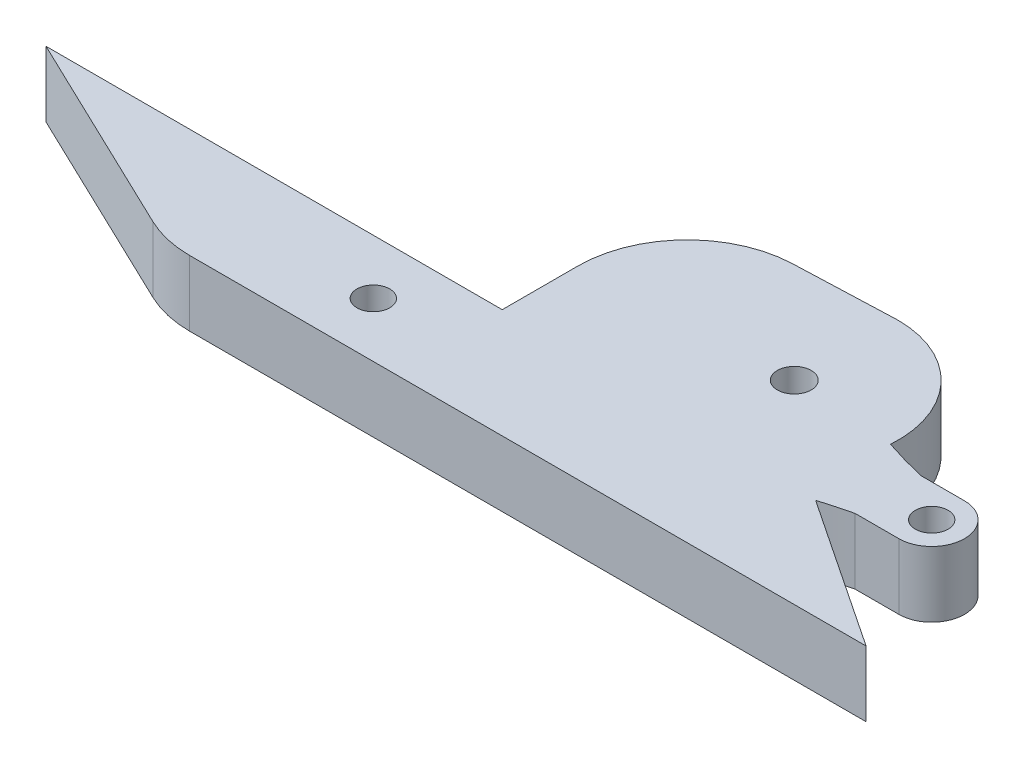
ISO-10303-21;
HEADER;
FILE_DESCRIPTION(('STEP AP214'),'2;1');
FILE_NAME('part.step','',(''),(''),'','','');
FILE_SCHEMA(('AUTOMOTIVE_DESIGN { 1 0 10303 214 1 1 1 1 }'));
ENDSEC;
DATA;
#1=APPLICATION_CONTEXT('core data for automotive mechanical design processes');
#2=APPLICATION_PROTOCOL_DEFINITION('international standard','automotive_design',2000,#1);
#3=PRODUCT_CONTEXT('',#1,'mechanical');
#4=PRODUCT('Part','Part','',(#3));
#5=PRODUCT_RELATED_PRODUCT_CATEGORY('part','',(#4));
#6=PRODUCT_DEFINITION_FORMATION('','',#4);
#7=PRODUCT_DEFINITION_CONTEXT('part definition',#1,'design');
#8=PRODUCT_DEFINITION('design','',#6,#7);
#9=PRODUCT_DEFINITION_SHAPE('','',#8);
#10=(LENGTH_UNIT() NAMED_UNIT(*) SI_UNIT(.MILLI.,.METRE.));
#11=(NAMED_UNIT(*) PLANE_ANGLE_UNIT() SI_UNIT($,.RADIAN.));
#12=(NAMED_UNIT(*) SI_UNIT($,.STERADIAN.) SOLID_ANGLE_UNIT());
#13=UNCERTAINTY_MEASURE_WITH_UNIT(LENGTH_MEASURE(1.E-05),#10,'distance_accuracy_value','');
#14=(GEOMETRIC_REPRESENTATION_CONTEXT(3) GLOBAL_UNCERTAINTY_ASSIGNED_CONTEXT((#13)) GLOBAL_UNIT_ASSIGNED_CONTEXT((#10,
#11,#12)) REPRESENTATION_CONTEXT('',''));
#15=CARTESIAN_POINT('',(0.,0.,0.));
#16=DIRECTION('',(0.,0.,1.));
#17=DIRECTION('',(1.,0.,0.));
#18=AXIS2_PLACEMENT_3D('',#15,#16,#17);
#19=CARTESIAN_POINT('',(1.15544671598219,6.,0.770297810654092));
#20=CARTESIAN_POINT('',(2.09450954617625,6.,0.48138849807879));
#21=CARTESIAN_POINT('',(3.04269397418197,6.,0.224622561194157));
#22=CARTESIAN_POINT('',(4.,6.,0.));
#23=B_SPLINE_CURVE_WITH_KNOTS('',3,(#19,#20,#21,#22),.UNSPECIFIED.,.F.,.F.,(4,4),
(0.26525085735006,1.),.UNSPECIFIED.);
#24=DIRECTION('',(0.,-1.,0.));
#25=VECTOR('',#24,1.);
#26=SURFACE_OF_LINEAR_EXTRUSION('',#23,#25);
#27=CARTESIAN_POINT('',(1.15544671598219,0.,0.770297810654092));
#28=CARTESIAN_POINT('',(2.09450954617625,0.,0.48138849807879));
#29=CARTESIAN_POINT('',(3.04269397418197,0.,0.224622561194157));
#30=CARTESIAN_POINT('',(4.,0.,0.));
#31=B_SPLINE_CURVE_WITH_KNOTS('',3,(#27,#28,#29,#30),.UNSPECIFIED.,.F.,.F.,(4,4),
(0.26525085735006,1.),.UNSPECIFIED.);
#32=CARTESIAN_POINT('',(1.15544671598219,0.,0.770297810654092));
#33=VERTEX_POINT('',#32);
#34=CARTESIAN_POINT('',(4.,0.,0.));
#35=VERTEX_POINT('',#34);
#36=EDGE_CURVE('E180',#33,#35,#31,.T.);
#37=ORIENTED_EDGE('',*,*,#36,.T.);
#38=DIRECTION('',(0.,-1.,0.));
#39=VECTOR('',#38,1.);
#40=CARTESIAN_POINT('',(4.,6.,0.));
#41=LINE('',#40,#39);
#42=CARTESIAN_POINT('',(4.,6.,0.));
#43=VERTEX_POINT('',#42);
#44=EDGE_CURVE('E11',#43,#35,#41,.T.);
#45=ORIENTED_EDGE('',*,*,#44,.F.);
#46=CARTESIAN_POINT('',(1.15544671598219,6.,0.770297810654092));
#47=VERTEX_POINT('',#46);
#48=EDGE_CURVE('E236',#47,#43,#23,.T.);
#49=ORIENTED_EDGE('',*,*,#48,.F.);
#50=DIRECTION('',(0.,-1.,0.));
#51=VECTOR('',#50,1.);
#52=CARTESIAN_POINT('',(1.15544671598219,6.,0.770297810654092));
#53=LINE('',#52,#51);
#54=EDGE_CURVE('E53',#47,#33,#53,.T.);
#55=ORIENTED_EDGE('',*,*,#54,.T.);
#56=EDGE_LOOP('',(#37,#45,#49,#55));
#57=FACE_BOUND('',#56,.T.);
#58=ADVANCED_FACE('F36',(#57),#26,.F.);
#59=CARTESIAN_POINT('',(0.,6.,0.));
#60=DIRECTION('',(0.,0.,-1.));
#61=DIRECTION('',(-1.,0.,0.));
#62=AXIS2_PLACEMENT_3D('',#59,#60,#61);
#63=PLANE('',#62);
#64=DIRECTION('',(1.,0.,0.));
#65=VECTOR('',#64,1.);
#66=CARTESIAN_POINT('',(0.,0.,0.));
#67=LINE('',#66,#65);
#68=CARTESIAN_POINT('',(8.,0.,0.));
#69=VERTEX_POINT('',#68);
#70=EDGE_CURVE('E184',#35,#69,#67,.T.);
#71=ORIENTED_EDGE('',*,*,#70,.T.);
#72=DIRECTION('',(0.,-1.,0.));
#73=VECTOR('',#72,1.);
#74=CARTESIAN_POINT('',(8.,6.,0.));
#75=LINE('',#74,#73);
#76=CARTESIAN_POINT('',(8.,6.,0.));
#77=VERTEX_POINT('',#76);
#78=EDGE_CURVE('E45',#77,#69,#75,.T.);
#79=ORIENTED_EDGE('',*,*,#78,.F.);
#80=DIRECTION('',(1.,0.,0.));
#81=VECTOR('',#80,1.);
#82=CARTESIAN_POINT('',(0.,6.,0.));
#83=LINE('',#82,#81);
#84=EDGE_CURVE('E109',#43,#77,#83,.T.);
#85=ORIENTED_EDGE('',*,*,#84,.F.);
#86=ORIENTED_EDGE('',*,*,#44,.T.);
#87=EDGE_LOOP('',(#71,#79,#85,#86));
#88=FACE_BOUND('',#87,.T.);
#89=ADVANCED_FACE('F300',(#88),#63,.F.);
#90=CARTESIAN_POINT('',(8.,6.,-3.));
#91=DIRECTION('',(0.,-1.,0.));
#92=DIRECTION('',(0.,0.,-1.));
#93=AXIS2_PLACEMENT_3D('',#90,#91,#92);
#94=CYLINDRICAL_SURFACE('',#93,3.);
#95=CARTESIAN_POINT('',(8.,0.,-3.));
#96=DIRECTION('',(0.,1.,0.));
#97=DIRECTION('',(0.,0.,1.));
#98=AXIS2_PLACEMENT_3D('',#95,#96,#97);
#99=CIRCLE('',#98,3.);
#100=CARTESIAN_POINT('',(8.,0.,-6.));
#101=VERTEX_POINT('',#100);
#102=EDGE_CURVE('E189',#69,#101,#99,.T.);
#103=ORIENTED_EDGE('',*,*,#102,.T.);
#104=DIRECTION('',(0.,-1.,0.));
#105=VECTOR('',#104,1.);
#106=CARTESIAN_POINT('',(8.,6.,-6.));
#107=LINE('',#106,#105);
#108=CARTESIAN_POINT('',(8.,6.,-6.));
#109=VERTEX_POINT('',#108);
#110=EDGE_CURVE('E254',#109,#101,#107,.T.);
#111=ORIENTED_EDGE('',*,*,#110,.F.);
#112=CARTESIAN_POINT('',(8.,6.,-3.));
#113=DIRECTION('',(0.,1.,0.));
#114=DIRECTION('',(0.,0.,1.));
#115=AXIS2_PLACEMENT_3D('',#112,#113,#114);
#116=CIRCLE('',#115,3.);
#117=EDGE_CURVE('E261',#77,#109,#116,.T.);
#118=ORIENTED_EDGE('',*,*,#117,.F.);
#119=ORIENTED_EDGE('',*,*,#78,.T.);
#120=EDGE_LOOP('',(#103,#111,#118,#119));
#121=FACE_BOUND('',#120,.T.);
#122=ADVANCED_FACE('F259',(#121),#94,.T.);
#123=CARTESIAN_POINT('',(0.,6.,-6.));
#124=DIRECTION('',(0.,0.,-1.));
#125=DIRECTION('',(-1.,0.,0.));
#126=AXIS2_PLACEMENT_3D('',#123,#124,#125);
#127=PLANE('',#126);
#128=DIRECTION('',(1.,0.,0.));
#129=VECTOR('',#128,1.);
#130=CARTESIAN_POINT('',(0.,0.,-6.));
#131=LINE('',#130,#129);
#132=CARTESIAN_POINT('',(4.,0.,-6.));
#133=VERTEX_POINT('',#132);
#134=EDGE_CURVE('E192',#133,#101,#131,.T.);
#135=ORIENTED_EDGE('',*,*,#134,.F.);
#136=DIRECTION('',(0.,-1.,0.));
#137=VECTOR('',#136,1.);
#138=CARTESIAN_POINT('',(4.,6.,-6.));
#139=LINE('',#138,#137);
#140=CARTESIAN_POINT('',(4.,6.,-6.));
#141=VERTEX_POINT('',#140);
#142=EDGE_CURVE('E252',#141,#133,#139,.T.);
#143=ORIENTED_EDGE('',*,*,#142,.F.);
#144=DIRECTION('',(1.,0.,0.));
#145=VECTOR('',#144,1.);
#146=CARTESIAN_POINT('',(0.,6.,-6.));
#147=LINE('',#146,#145);
#148=EDGE_CURVE('E272',#141,#109,#147,.T.);
#149=ORIENTED_EDGE('',*,*,#148,.T.);
#150=ORIENTED_EDGE('',*,*,#110,.T.);
#151=EDGE_LOOP('',(#135,#143,#149,#150));
#152=FACE_BOUND('',#151,.T.);
#153=ADVANCED_FACE('F269',(#152),#127,.T.);
#154=CARTESIAN_POINT('',(0.141983447062552,6.,-7.09576164428797));
#155=CARTESIAN_POINT('',(2.04564720749744,6.,-6.45856990125361));
#156=CARTESIAN_POINT('',(4.,6.,-6.));
#157=B_SPLINE_CURVE_WITH_KNOTS('',2,(#154,#155,#156),.UNSPECIFIED.,.F.,.F.,(3,3),(0.,1.),.UNSPECIFIED.);
#158=DIRECTION('',(0.,-1.,0.));
#159=VECTOR('',#158,1.);
#160=SURFACE_OF_LINEAR_EXTRUSION('',#157,#159);
#161=CARTESIAN_POINT('',(0.141983447062552,0.,-7.09576164428797));
#162=CARTESIAN_POINT('',(2.04564720749744,0.,-6.45856990125361));
#163=CARTESIAN_POINT('',(4.,0.,-6.));
#164=B_SPLINE_CURVE_WITH_KNOTS('',2,(#161,#162,#163),.UNSPECIFIED.,.F.,.F.,(3,3),(0.,1.),.UNSPECIFIED.);
#165=CARTESIAN_POINT('',(0.141983447062552,0.,-7.09576164428797));
#166=VERTEX_POINT('',#165);
#167=EDGE_CURVE('E195',#166,#133,#164,.T.);
#168=ORIENTED_EDGE('',*,*,#167,.F.);
#169=DIRECTION('',(0.,-1.,0.));
#170=VECTOR('',#169,1.);
#171=CARTESIAN_POINT('',(0.141983447062552,6.,-7.09576164428797));
#172=LINE('',#171,#170);
#173=CARTESIAN_POINT('',(0.141983447062552,6.,-7.09576164428797));
#174=VERTEX_POINT('',#173);
#175=EDGE_CURVE('E250',#174,#166,#172,.T.);
#176=ORIENTED_EDGE('',*,*,#175,.F.);
#177=EDGE_CURVE('E275',#174,#141,#157,.T.);
#178=ORIENTED_EDGE('',*,*,#177,.T.);
#179=ORIENTED_EDGE('',*,*,#142,.T.);
#180=EDGE_LOOP('',(#168,#176,#178,#179));
#181=FACE_BOUND('',#180,.T.);
#182=ADVANCED_FACE('F290',(#181),#160,.T.);
#183=CARTESIAN_POINT('',(-9.33430338024911,6.,-7.76657306825106));
#184=DIRECTION('',(0.,-1.,0.));
#185=DIRECTION('',(0.,0.,-1.));
#186=AXIS2_PLACEMENT_3D('',#183,#184,#185);
#187=CYLINDRICAL_SURFACE('',#186,9.5);
#188=CARTESIAN_POINT('',(-9.33430338024911,0.,-7.76657306825106));
#189=DIRECTION('',(0.,1.,0.));
#190=DIRECTION('',(0.,0.,1.));
#191=AXIS2_PLACEMENT_3D('',#188,#189,#190);
#192=CIRCLE('',#191,9.5);
#193=CARTESIAN_POINT('',(-9.33430338024912,0.,-17.2665730682511));
#194=VERTEX_POINT('',#193);
#195=EDGE_CURVE('E200',#166,#194,#192,.T.);
#196=ORIENTED_EDGE('',*,*,#195,.T.);
#197=DIRECTION('',(0.,-1.,0.));
#198=VECTOR('',#197,1.);
#199=CARTESIAN_POINT('',(-9.33430338024912,6.,-17.2665730682511));
#200=LINE('',#199,#198);
#201=CARTESIAN_POINT('',(-9.33430338024912,6.,-17.2665730682511));
#202=VERTEX_POINT('',#201);
#203=EDGE_CURVE('E248',#202,#194,#200,.T.);
#204=ORIENTED_EDGE('',*,*,#203,.F.);
#205=CARTESIAN_POINT('',(-9.33430338024911,6.,-7.76657306825106));
#206=DIRECTION('',(0.,1.,0.));
#207=DIRECTION('',(0.,0.,1.));
#208=AXIS2_PLACEMENT_3D('',#205,#206,#207);
#209=CIRCLE('',#208,9.5);
#210=EDGE_CURVE('E277',#174,#202,#209,.T.);
#211=ORIENTED_EDGE('',*,*,#210,.F.);
#212=ORIENTED_EDGE('',*,*,#175,.T.);
#213=EDGE_LOOP('',(#196,#204,#211,#212));
#214=FACE_BOUND('',#213,.T.);
#215=ADVANCED_FACE('F294',(#214),#187,.T.);
#216=CARTESIAN_POINT('',(-0.667994009795977,6.,-17.5955786029445));
#217=DIRECTION('',(-0.0379364141874344,0.,-0.999280155150996));
#218=DIRECTION('',(-0.999280155150996,0.,0.0379364141874344));
#219=AXIS2_PLACEMENT_3D('',#216,#217,#218);
#220=PLANE('',#219);
#221=DIRECTION('',(0.999280155150996,0.,-0.0379364141874344));
#222=VECTOR('',#221,1.);
#223=CARTESIAN_POINT('',(-0.667994009795977,0.,-17.5955786029445));
#224=LINE('',#223,#222);
#225=CARTESIAN_POINT('',(-18.6545724164585,0.,-16.9127407774031));
#226=VERTEX_POINT('',#225);
#227=EDGE_CURVE('E206',#226,#194,#224,.T.);
#228=ORIENTED_EDGE('',*,*,#227,.F.);
#229=DIRECTION('',(0.,-1.,0.));
#230=VECTOR('',#229,1.);
#231=CARTESIAN_POINT('',(-18.6545724164585,6.,-16.9127407774031));
#232=LINE('',#231,#230);
#233=CARTESIAN_POINT('',(-18.6545724164585,6.,-16.9127407774031));
#234=VERTEX_POINT('',#233);
#235=EDGE_CURVE('E246',#234,#226,#232,.T.);
#236=ORIENTED_EDGE('',*,*,#235,.F.);
#237=DIRECTION('',(0.999280155150996,0.,-0.0379364141874344));
#238=VECTOR('',#237,1.);
#239=CARTESIAN_POINT('',(-0.667994009795977,6.,-17.5955786029445));
#240=LINE('',#239,#238);
#241=EDGE_CURVE('E360',#234,#202,#240,.T.);
#242=ORIENTED_EDGE('',*,*,#241,.T.);
#243=ORIENTED_EDGE('',*,*,#203,.T.);
#244=EDGE_LOOP('',(#228,#236,#242,#243));
#245=FACE_BOUND('',#244,.T.);
#246=ADVANCED_FACE('F340',(#245),#220,.T.);
#247=CARTESIAN_POINT('',(-18.2752082745844,6.,-6.91993922589314));
#248=DIRECTION('',(0.,-1.,0.));
#249=DIRECTION('',(0.,0.,-1.));
#250=AXIS2_PLACEMENT_3D('',#247,#248,#249);
#251=CYLINDRICAL_SURFACE('',#250,9.9999999999999);
#252=CARTESIAN_POINT('',(-18.2752082745844,0.,-6.91993922589314));
#253=DIRECTION('',(0.,1.,0.));
#254=DIRECTION('',(0.,0.,1.));
#255=AXIS2_PLACEMENT_3D('',#252,#253,#254);
#256=CIRCLE('',#255,9.9999999999999);
#257=CARTESIAN_POINT('',(-28.2752082745842,0.,-6.91993922589316));
#258=VERTEX_POINT('',#257);
#259=EDGE_CURVE('E209',#226,#258,#256,.T.);
#260=ORIENTED_EDGE('',*,*,#259,.T.);
#261=DIRECTION('',(0.,-1.,0.));
#262=VECTOR('',#261,1.);
#263=CARTESIAN_POINT('',(-28.2752082745842,6.,-6.91993922589316));
#264=LINE('',#263,#262);
#265=CARTESIAN_POINT('',(-28.2752082745842,6.,-6.91993922589316));
#266=VERTEX_POINT('',#265);
#267=EDGE_CURVE('E244',#266,#258,#264,.T.);
#268=ORIENTED_EDGE('',*,*,#267,.F.);
#269=CARTESIAN_POINT('',(-18.2752082745844,6.,-6.91993922589314));
#270=DIRECTION('',(0.,1.,0.));
#271=DIRECTION('',(0.,0.,1.));
#272=AXIS2_PLACEMENT_3D('',#269,#270,#271);
#273=CIRCLE('',#272,9.9999999999999);
#274=EDGE_CURVE('E356',#234,#266,#273,.T.);
#275=ORIENTED_EDGE('',*,*,#274,.F.);
#276=ORIENTED_EDGE('',*,*,#235,.T.);
#277=EDGE_LOOP('',(#260,#268,#275,#276));
#278=FACE_BOUND('',#277,.T.);
#279=ADVANCED_FACE('F337',(#278),#251,.T.);
#280=CARTESIAN_POINT('',(-28.2752082745844,6.,-1.11992999143204E-12));
#281=DIRECTION('',(-1.,0.,0.));
#282=DIRECTION('',(0.,0.,1.));
#283=AXIS2_PLACEMENT_3D('',#280,#281,#282);
#284=PLANE('',#283);
#285=DIRECTION('',(0.,0.,-1.));
#286=VECTOR('',#285,1.);
#287=CARTESIAN_POINT('',(-28.2752082745844,0.,-1.11992999143204E-12));
#288=LINE('',#287,#286);
#289=CARTESIAN_POINT('',(-28.2752082745844,0.,0.));
#290=VERTEX_POINT('',#289);
#291=EDGE_CURVE('E212',#290,#258,#288,.T.);
#292=ORIENTED_EDGE('',*,*,#291,.F.);
#293=DIRECTION('',(0.,-1.,0.));
#294=VECTOR('',#293,1.);
#295=CARTESIAN_POINT('',(-28.2752082745844,6.,0.));
#296=LINE('',#295,#294);
#297=CARTESIAN_POINT('',(-28.2752082745844,6.,0.));
#298=VERTEX_POINT('',#297);
#299=EDGE_CURVE('E242',#298,#290,#296,.T.);
#300=ORIENTED_EDGE('',*,*,#299,.F.);
#301=DIRECTION('',(0.,0.,-1.));
#302=VECTOR('',#301,1.);
#303=CARTESIAN_POINT('',(-28.2752082745844,6.,-1.11992999143204E-12));
#304=LINE('',#303,#302);
#305=EDGE_CURVE('E359',#298,#266,#304,.T.);
#306=ORIENTED_EDGE('',*,*,#305,.T.);
#307=ORIENTED_EDGE('',*,*,#267,.T.);
#308=EDGE_LOOP('',(#292,#300,#306,#307));
#309=FACE_BOUND('',#308,.T.);
#310=ADVANCED_FACE('F333',(#309),#284,.T.);
#311=CARTESIAN_POINT('',(0.,6.,0.));
#312=DIRECTION('',(0.,0.,-1.));
#313=DIRECTION('',(-1.,0.,0.));
#314=AXIS2_PLACEMENT_3D('',#311,#312,#313);
#315=PLANE('',#314);
#316=DIRECTION('',(1.,0.,0.));
#317=VECTOR('',#316,1.);
#318=CARTESIAN_POINT('',(0.,0.,0.));
#319=LINE('',#318,#317);
#320=CARTESIAN_POINT('',(-69.9999999999863,0.,0.));
#321=VERTEX_POINT('',#320);
#322=EDGE_CURVE('E215',#321,#290,#319,.T.);
#323=ORIENTED_EDGE('',*,*,#322,.F.);
#324=DIRECTION('',(0.,-1.,0.));
#325=VECTOR('',#324,1.);
#326=CARTESIAN_POINT('',(-69.9999999999863,6.,0.));
#327=LINE('',#326,#325);
#328=CARTESIAN_POINT('',(-69.9999999999863,6.,0.));
#329=VERTEX_POINT('',#328);
#330=EDGE_CURVE('E240',#329,#321,#327,.T.);
#331=ORIENTED_EDGE('',*,*,#330,.F.);
#332=DIRECTION('',(1.,0.,0.));
#333=VECTOR('',#332,1.);
#334=CARTESIAN_POINT('',(0.,6.,0.));
#335=LINE('',#334,#333);
#336=EDGE_CURVE('E365',#329,#298,#335,.T.);
#337=ORIENTED_EDGE('',*,*,#336,.T.);
#338=ORIENTED_EDGE('',*,*,#299,.T.);
#339=EDGE_LOOP('',(#323,#331,#337,#338));
#340=FACE_BOUND('',#339,.T.);
#341=ADVANCED_FACE('F329',(#340),#315,.T.);
#342=CARTESIAN_POINT('',(-13.0782559966181,6.,27.28437537951));
#343=DIRECTION('',(-0.432240938046308,0.,0.901758155758431));
#344=DIRECTION('',(0.901758155758432,0.,0.432240938046309));
#345=AXIS2_PLACEMENT_3D('',#342,#343,#344);
#346=PLANE('',#345);
#347=DIRECTION('',(-0.901758155758431,0.,-0.432240938046308));
#348=VECTOR('',#347,1.);
#349=CARTESIAN_POINT('',(-13.0782559966181,0.,27.28437537951));
#350=LINE('',#349,#348);
#351=CARTESIAN_POINT('',(-51.187164382141,0.,9.01758155758431));
#352=VERTEX_POINT('',#351);
#353=EDGE_CURVE('E218',#352,#321,#350,.T.);
#354=ORIENTED_EDGE('',*,*,#353,.F.);
#355=DIRECTION('',(0.,-1.,0.));
#356=VECTOR('',#355,1.);
#357=CARTESIAN_POINT('',(-51.187164382141,6.,9.01758155758431));
#358=LINE('',#357,#356);
#359=CARTESIAN_POINT('',(-51.187164382141,6.,9.01758155758431));
#360=VERTEX_POINT('',#359);
#361=EDGE_CURVE('E152',#360,#352,#358,.T.);
#362=ORIENTED_EDGE('',*,*,#361,.F.);
#363=DIRECTION('',(-0.901758155758431,0.,-0.432240938046308));
#364=VECTOR('',#363,1.);
#365=CARTESIAN_POINT('',(-13.0782559966181,6.,27.28437537951));
#366=LINE('',#365,#364);
#367=EDGE_CURVE('E163',#360,#329,#366,.T.);
#368=ORIENTED_EDGE('',*,*,#367,.T.);
#369=ORIENTED_EDGE('',*,*,#330,.T.);
#370=EDGE_LOOP('',(#354,#362,#368,#369));
#371=FACE_BOUND('',#370,.T.);
#372=ADVANCED_FACE('F326',(#371),#346,.T.);
#373=CARTESIAN_POINT('',(-46.8647550016779,6.,0.));
#374=DIRECTION('',(0.,-1.,0.));
#375=DIRECTION('',(0.,0.,-1.));
#376=AXIS2_PLACEMENT_3D('',#373,#374,#375);
#377=CYLINDRICAL_SURFACE('',#376,10.);
#378=CARTESIAN_POINT('',(-46.8647550016779,0.,0.));
#379=DIRECTION('',(0.,1.,0.));
#380=DIRECTION('',(0.,0.,1.));
#381=AXIS2_PLACEMENT_3D('',#378,#379,#380);
#382=CIRCLE('',#381,10.);
#383=CARTESIAN_POINT('',(-46.8647550016778,0.,10.));
#384=VERTEX_POINT('',#383);
#385=EDGE_CURVE('E148',#384,#352,#382,.F.);
#386=ORIENTED_EDGE('',*,*,#385,.F.);
#387=DIRECTION('',(0.,-1.,0.));
#388=VECTOR('',#387,1.);
#389=CARTESIAN_POINT('',(-46.8647550016778,6.,10.));
#390=LINE('',#389,#388);
#391=CARTESIAN_POINT('',(-46.8647550016778,6.,10.));
#392=VERTEX_POINT('',#391);
#393=EDGE_CURVE('E143',#392,#384,#390,.T.);
#394=ORIENTED_EDGE('',*,*,#393,.F.);
#395=CARTESIAN_POINT('',(-46.8647550016779,6.,0.));
#396=DIRECTION('',(0.,1.,0.));
#397=DIRECTION('',(0.,0.,1.));
#398=AXIS2_PLACEMENT_3D('',#395,#396,#397);
#399=CIRCLE('',#398,10.);
#400=EDGE_CURVE('E146',#392,#360,#399,.F.);
#401=ORIENTED_EDGE('',*,*,#400,.T.);
#402=ORIENTED_EDGE('',*,*,#361,.T.);
#403=EDGE_LOOP('',(#386,#394,#401,#402));
#404=FACE_BOUND('',#403,.T.);
#405=ADVANCED_FACE('F145',(#404),#377,.T.);
#406=CARTESIAN_POINT('',(0.,6.,10.));
#407=DIRECTION('',(0.,0.,1.));
#408=DIRECTION('',(1.,0.,0.));
#409=AXIS2_PLACEMENT_3D('',#406,#407,#408);
#410=PLANE('',#409);
#411=DIRECTION('',(-1.,0.,0.));
#412=VECTOR('',#411,1.);
#413=CARTESIAN_POINT('',(0.,0.,10.));
#414=LINE('',#413,#412);
#415=CARTESIAN_POINT('',(15.0000000000137,0.,10.));
#416=VERTEX_POINT('',#415);
#417=EDGE_CURVE('E222',#416,#384,#414,.T.);
#418=ORIENTED_EDGE('',*,*,#417,.F.);
#419=DIRECTION('',(0.,-1.,0.));
#420=VECTOR('',#419,1.);
#421=CARTESIAN_POINT('',(15.0000000000137,6.,10.));
#422=LINE('',#421,#420);
#423=CARTESIAN_POINT('',(15.0000000000137,6.,10.));
#424=VERTEX_POINT('',#423);
#425=EDGE_CURVE('E97',#424,#416,#422,.T.);
#426=ORIENTED_EDGE('',*,*,#425,.F.);
#427=DIRECTION('',(-1.,0.,0.));
#428=VECTOR('',#427,1.);
#429=CARTESIAN_POINT('',(0.,6.,10.));
#430=LINE('',#429,#428);
#431=EDGE_CURVE('E160',#424,#392,#430,.T.);
#432=ORIENTED_EDGE('',*,*,#431,.T.);
#433=ORIENTED_EDGE('',*,*,#393,.T.);
#434=EDGE_LOOP('',(#418,#426,#432,#433));
#435=FACE_BOUND('',#434,.T.);
#436=ADVANCED_FACE('F165',(#435),#410,.T.);
#437=CARTESIAN_POINT('',(-35.0638414589827,6.,5.));
#438=DIRECTION('',(0.,-1.,0.));
#439=DIRECTION('',(0.,0.,-1.));
#440=AXIS2_PLACEMENT_3D('',#437,#438,#439);
#441=CYLINDRICAL_SURFACE('',#440,1.5);
#442=CARTESIAN_POINT('',(-35.0638414589827,6.,5.));
#443=DIRECTION('',(0.,1.,0.));
#444=DIRECTION('',(0.,0.,1.));
#445=AXIS2_PLACEMENT_3D('',#442,#443,#444);
#446=CIRCLE('',#445,1.5);
#447=CARTESIAN_POINT('',(-35.0638414589827,6.,6.50000000000001));
#448=VERTEX_POINT('',#447);
#449=EDGE_CURVE('E174',#448,#448,#446,.T.);
#450=ORIENTED_EDGE('',*,*,#449,.T.);
#451=EDGE_LOOP('',(#450));
#452=FACE_BOUND('',#451,.T.);
#453=CARTESIAN_POINT('',(-35.0638414589827,0.,5.));
#454=DIRECTION('',(0.,1.,0.));
#455=DIRECTION('',(0.,0.,1.));
#456=AXIS2_PLACEMENT_3D('',#453,#454,#455);
#457=CIRCLE('',#456,1.5);
#458=CARTESIAN_POINT('',(-35.0638414589827,0.,6.50000000000001));
#459=VERTEX_POINT('',#458);
#460=EDGE_CURVE('E230',#459,#459,#457,.T.);
#461=ORIENTED_EDGE('',*,*,#460,.F.);
#462=EDGE_LOOP('',(#461));
#463=FACE_BOUND('',#462,.T.);
#464=ADVANCED_FACE('F317',(#452,#463),#441,.F.);
#465=CARTESIAN_POINT('',(-9.33430338024911,6.,-7.76657306825106));
#466=DIRECTION('',(0.,-1.,0.));
#467=DIRECTION('',(0.,0.,-1.));
#468=AXIS2_PLACEMENT_3D('',#465,#466,#467);
#469=CYLINDRICAL_SURFACE('',#468,1.55);
#470=CARTESIAN_POINT('',(-9.33430338024911,6.,-7.76657306825106));
#471=DIRECTION('',(0.,1.,0.));
#472=DIRECTION('',(0.,0.,1.));
#473=AXIS2_PLACEMENT_3D('',#470,#471,#472);
#474=CIRCLE('',#473,1.55);
#475=CARTESIAN_POINT('',(-9.33430338024911,6.,-6.21657306825106));
#476=VERTEX_POINT('',#475);
#477=EDGE_CURVE('E168',#476,#476,#474,.T.);
#478=ORIENTED_EDGE('',*,*,#477,.T.);
#479=EDGE_LOOP('',(#478));
#480=FACE_BOUND('',#479,.T.);
#481=CARTESIAN_POINT('',(-9.33430338024911,0.,-7.76657306825106));
#482=DIRECTION('',(0.,1.,0.));
#483=DIRECTION('',(0.,0.,1.));
#484=AXIS2_PLACEMENT_3D('',#481,#482,#483);
#485=CIRCLE('',#484,1.55);
#486=CARTESIAN_POINT('',(-9.33430338024911,0.,-6.21657306825106));
#487=VERTEX_POINT('',#486);
#488=EDGE_CURVE('E227',#487,#487,#485,.T.);
#489=ORIENTED_EDGE('',*,*,#488,.F.);
#490=EDGE_LOOP('',(#489));
#491=FACE_BOUND('',#490,.T.);
#492=ADVANCED_FACE('F309',(#480,#491),#469,.F.);
#493=CARTESIAN_POINT('',(0.,6.,0.));
#494=DIRECTION('',(0.554700196224879,0.,-0.832050294338077));
#495=DIRECTION('',(-0.832050294338077,0.,-0.554700196224879));
#496=AXIS2_PLACEMENT_3D('',#493,#494,#495);
#497=PLANE('',#496);
#498=DIRECTION('',(0.832050294338077,0.,0.554700196224879));
#499=VECTOR('',#498,1.);
#500=CARTESIAN_POINT('',(0.,0.,0.));
#501=LINE('',#500,#499);
#502=EDGE_CURVE('E224',#33,#416,#501,.T.);
#503=ORIENTED_EDGE('',*,*,#502,.F.);
#504=ORIENTED_EDGE('',*,*,#54,.F.);
#505=DIRECTION('',(0.832050294338077,0.,0.554700196224879));
#506=VECTOR('',#505,1.);
#507=CARTESIAN_POINT('',(0.,6.,0.));
#508=LINE('',#507,#506);
#509=EDGE_CURVE('E166',#47,#424,#508,.T.);
#510=ORIENTED_EDGE('',*,*,#509,.T.);
#511=ORIENTED_EDGE('',*,*,#425,.T.);
#512=EDGE_LOOP('',(#503,#504,#510,#511));
#513=FACE_BOUND('',#512,.T.);
#514=ADVANCED_FACE('F306',(#513),#497,.T.);
#515=CARTESIAN_POINT('',(8.,6.,-3.));
#516=DIRECTION('',(0.,-1.,0.));
#517=DIRECTION('',(0.,0.,-1.));
#518=AXIS2_PLACEMENT_3D('',#515,#516,#517);
#519=CYLINDRICAL_SURFACE('',#518,1.5);
#520=CARTESIAN_POINT('',(8.,6.,-3.));
#521=DIRECTION('',(0.,1.,0.));
#522=DIRECTION('',(0.,0.,1.));
#523=AXIS2_PLACEMENT_3D('',#520,#521,#522);
#524=CIRCLE('',#523,1.5);
#525=CARTESIAN_POINT('',(8.,6.,-1.5));
#526=VERTEX_POINT('',#525);
#527=EDGE_CURVE('E177',#526,#526,#524,.T.);
#528=ORIENTED_EDGE('',*,*,#527,.T.);
#529=EDGE_LOOP('',(#528));
#530=FACE_BOUND('',#529,.T.);
#531=CARTESIAN_POINT('',(8.,0.,-3.));
#532=DIRECTION('',(0.,1.,0.));
#533=DIRECTION('',(0.,0.,1.));
#534=AXIS2_PLACEMENT_3D('',#531,#532,#533);
#535=CIRCLE('',#534,1.5);
#536=CARTESIAN_POINT('',(8.,0.,-1.5));
#537=VERTEX_POINT('',#536);
#538=EDGE_CURVE('E233',#537,#537,#535,.T.);
#539=ORIENTED_EDGE('',*,*,#538,.F.);
#540=EDGE_LOOP('',(#539));
#541=FACE_BOUND('',#540,.T.);
#542=ADVANCED_FACE('F308',(#530,#541),#519,.F.);
#543=CARTESIAN_POINT('',(0.,6.,0.));
#544=DIRECTION('',(0.,1.,0.));
#545=DIRECTION('',(0.,0.,1.));
#546=AXIS2_PLACEMENT_3D('',#543,#544,#545);
#547=PLANE('',#546);
#548=ORIENTED_EDGE('',*,*,#48,.T.);
#549=ORIENTED_EDGE('',*,*,#84,.T.);
#550=ORIENTED_EDGE('',*,*,#117,.T.);
#551=ORIENTED_EDGE('',*,*,#148,.F.);
#552=ORIENTED_EDGE('',*,*,#177,.F.);
#553=ORIENTED_EDGE('',*,*,#210,.T.);
#554=ORIENTED_EDGE('',*,*,#241,.F.);
#555=ORIENTED_EDGE('',*,*,#274,.T.);
#556=ORIENTED_EDGE('',*,*,#305,.F.);
#557=ORIENTED_EDGE('',*,*,#336,.F.);
#558=ORIENTED_EDGE('',*,*,#367,.F.);
#559=ORIENTED_EDGE('',*,*,#400,.F.);
#560=ORIENTED_EDGE('',*,*,#431,.F.);
#561=ORIENTED_EDGE('',*,*,#509,.F.);
#562=EDGE_LOOP('',(#548,#549,#550,#551,#552,#553,#554,#555,#556,#557,#558,#559,#560,#561));
#563=FACE_BOUND('',#562,.T.);
#564=ORIENTED_EDGE('',*,*,#477,.F.);
#565=EDGE_LOOP('',(#564));
#566=FACE_BOUND('',#565,.T.);
#567=ORIENTED_EDGE('',*,*,#449,.F.);
#568=EDGE_LOOP('',(#567));
#569=FACE_BOUND('',#568,.T.);
#570=ORIENTED_EDGE('',*,*,#527,.F.);
#571=EDGE_LOOP('',(#570));
#572=FACE_BOUND('',#571,.T.);
#573=ADVANCED_FACE('F157',(#563,#566,#569,#572),#547,.T.);
#574=CARTESIAN_POINT('',(0.,0.,0.));
#575=DIRECTION('',(0.,1.,0.));
#576=DIRECTION('',(0.,0.,1.));
#577=AXIS2_PLACEMENT_3D('',#574,#575,#576);
#578=PLANE('',#577);
#579=ORIENTED_EDGE('',*,*,#36,.F.);
#580=ORIENTED_EDGE('',*,*,#502,.T.);
#581=ORIENTED_EDGE('',*,*,#417,.T.);
#582=ORIENTED_EDGE('',*,*,#385,.T.);
#583=ORIENTED_EDGE('',*,*,#353,.T.);
#584=ORIENTED_EDGE('',*,*,#322,.T.);
#585=ORIENTED_EDGE('',*,*,#291,.T.);
#586=ORIENTED_EDGE('',*,*,#259,.F.);
#587=ORIENTED_EDGE('',*,*,#227,.T.);
#588=ORIENTED_EDGE('',*,*,#195,.F.);
#589=ORIENTED_EDGE('',*,*,#167,.T.);
#590=ORIENTED_EDGE('',*,*,#134,.T.);
#591=ORIENTED_EDGE('',*,*,#102,.F.);
#592=ORIENTED_EDGE('',*,*,#70,.F.);
#593=EDGE_LOOP('',(#579,#580,#581,#582,#583,#584,#585,#586,#587,#588,#589,#590,#591,#592));
#594=FACE_BOUND('',#593,.T.);
#595=ORIENTED_EDGE('',*,*,#488,.T.);
#596=EDGE_LOOP('',(#595));
#597=FACE_BOUND('',#596,.T.);
#598=ORIENTED_EDGE('',*,*,#460,.T.);
#599=EDGE_LOOP('',(#598));
#600=FACE_BOUND('',#599,.T.);
#601=ORIENTED_EDGE('',*,*,#538,.T.);
#602=EDGE_LOOP('',(#601));
#603=FACE_BOUND('',#602,.T.);
#604=ADVANCED_FACE('F263',(#594,#597,#600,#603),#578,.F.);
#605=CLOSED_SHELL('',(#58,#89,#122,#153,#182,#215,#246,#279,#310,#341,#372,#405,#436,#464,#492,
#514,#542,#573,#604));
#606=MANIFOLD_SOLID_BREP('B2',#605);
#607=ADVANCED_BREP_SHAPE_REPRESENTATION('',(#18,#606),#14);
#608=SHAPE_DEFINITION_REPRESENTATION(#9,#607);
ENDSEC;
END-ISO-10303-21;
